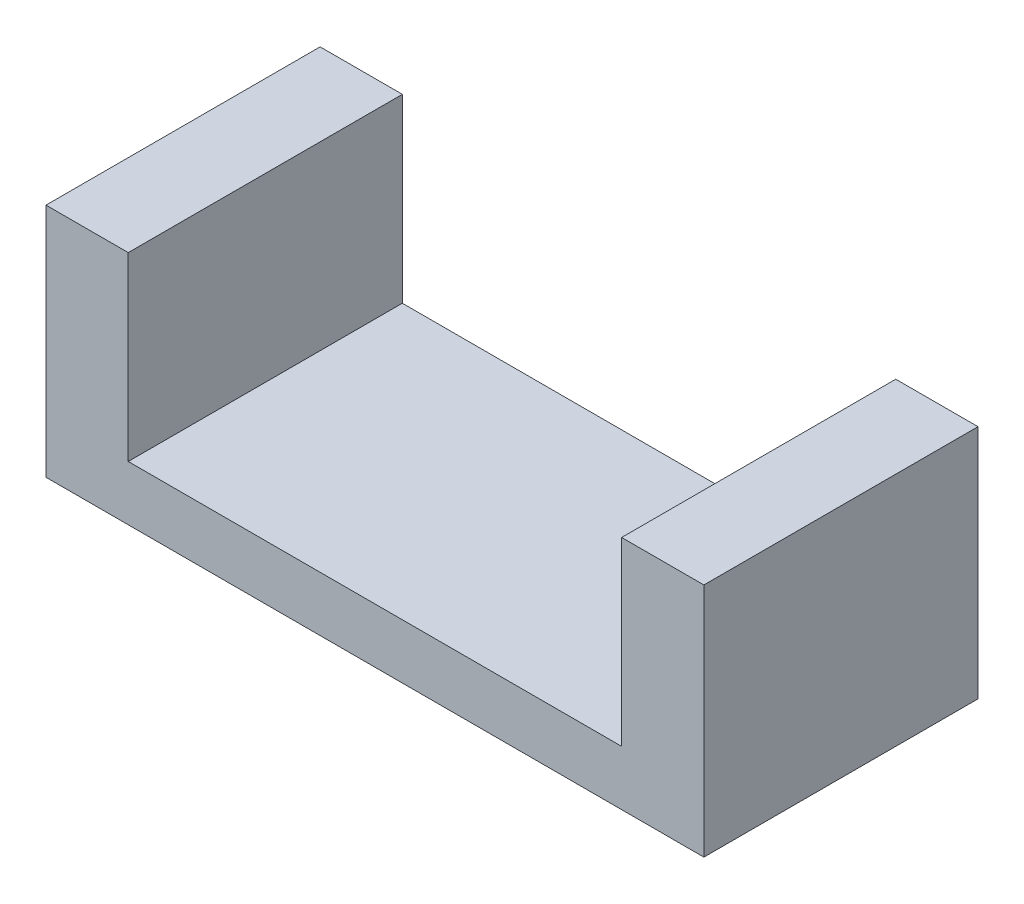
ISO-10303-21;
HEADER;
FILE_DESCRIPTION(('STEP AP214'),'2;1');
FILE_NAME('part.step','',(''),(''),'','','');
FILE_SCHEMA(('AUTOMOTIVE_DESIGN { 1 0 10303 214 1 1 1 1 }'));
ENDSEC;
DATA;
#1=APPLICATION_CONTEXT('core data for automotive mechanical design processes');
#2=APPLICATION_PROTOCOL_DEFINITION('international standard','automotive_design',2000,#1);
#3=PRODUCT_CONTEXT('',#1,'mechanical');
#4=PRODUCT('Part','Part','',(#3));
#5=PRODUCT_RELATED_PRODUCT_CATEGORY('part','',(#4));
#6=PRODUCT_DEFINITION_FORMATION('','',#4);
#7=PRODUCT_DEFINITION_CONTEXT('part definition',#1,'design');
#8=PRODUCT_DEFINITION('design','',#6,#7);
#9=PRODUCT_DEFINITION_SHAPE('','',#8);
#10=(LENGTH_UNIT() NAMED_UNIT(*) SI_UNIT(.MILLI.,.METRE.));
#11=(NAMED_UNIT(*) PLANE_ANGLE_UNIT() SI_UNIT($,.RADIAN.));
#12=(NAMED_UNIT(*) SI_UNIT($,.STERADIAN.) SOLID_ANGLE_UNIT());
#13=UNCERTAINTY_MEASURE_WITH_UNIT(LENGTH_MEASURE(1.E-05),#10,'distance_accuracy_value','');
#14=(GEOMETRIC_REPRESENTATION_CONTEXT(3) GLOBAL_UNCERTAINTY_ASSIGNED_CONTEXT((#13)) GLOBAL_UNIT_ASSIGNED_CONTEXT((#10,
#11,#12)) REPRESENTATION_CONTEXT('',''));
#15=CARTESIAN_POINT('',(0.,0.,0.));
#16=DIRECTION('',(0.,0.,1.));
#17=DIRECTION('',(1.,0.,0.));
#18=AXIS2_PLACEMENT_3D('',#15,#16,#17);
#19=CARTESIAN_POINT('',(0.,1.,2.5));
#20=DIRECTION('',(0.,0.,1.));
#21=DIRECTION('',(1.,0.,0.));
#22=AXIS2_PLACEMENT_3D('',#19,#20,#21);
#23=PLANE('',#22);
#24=DIRECTION('',(-1.,0.,0.));
#25=VECTOR('',#24,1.);
#26=CARTESIAN_POINT('',(0.,0.,2.5));
#27=LINE('',#26,#25);
#28=CARTESIAN_POINT('',(6.,0.,2.5));
#29=VERTEX_POINT('',#28);
#30=CARTESIAN_POINT('',(-6.,0.,2.5));
#31=VERTEX_POINT('',#30);
#32=EDGE_CURVE('E182',#29,#31,#27,.T.);
#33=ORIENTED_EDGE('',*,*,#32,.F.);
#34=DIRECTION('',(0.,-1.,0.));
#35=VECTOR('',#34,1.);
#36=CARTESIAN_POINT('',(6.,4.3,2.5));
#37=LINE('',#36,#35);
#38=CARTESIAN_POINT('',(6.,4.3,2.5));
#39=VERTEX_POINT('',#38);
#40=EDGE_CURVE('E165',#39,#29,#37,.T.);
#41=ORIENTED_EDGE('',*,*,#40,.F.);
#42=DIRECTION('',(-1.,0.,0.));
#43=VECTOR('',#42,1.);
#44=CARTESIAN_POINT('',(0.,4.3,2.5));
#45=LINE('',#44,#43);
#46=CARTESIAN_POINT('',(4.5,4.3,2.5));
#47=VERTEX_POINT('',#46);
#48=EDGE_CURVE('E161',#39,#47,#45,.T.);
#49=ORIENTED_EDGE('',*,*,#48,.T.);
#50=DIRECTION('',(0.,-1.,0.));
#51=VECTOR('',#50,1.);
#52=CARTESIAN_POINT('',(4.5,4.3,2.5));
#53=LINE('',#52,#51);
#54=CARTESIAN_POINT('',(4.5,1.,2.5));
#55=VERTEX_POINT('',#54);
#56=EDGE_CURVE('E172',#47,#55,#53,.T.);
#57=ORIENTED_EDGE('',*,*,#56,.T.);
#58=DIRECTION('',(-1.,0.,0.));
#59=VECTOR('',#58,1.);
#60=CARTESIAN_POINT('',(0.,1.,2.5));
#61=LINE('',#60,#59);
#62=CARTESIAN_POINT('',(-4.5,1.,2.5));
#63=VERTEX_POINT('',#62);
#64=EDGE_CURVE('E185',#55,#63,#61,.T.);
#65=ORIENTED_EDGE('',*,*,#64,.T.);
#66=DIRECTION('',(0.,-1.,0.));
#67=VECTOR('',#66,1.);
#68=CARTESIAN_POINT('',(-4.5,4.3,2.5));
#69=LINE('',#68,#67);
#70=CARTESIAN_POINT('',(-4.5,4.3,2.5));
#71=VERTEX_POINT('',#70);
#72=EDGE_CURVE('E119',#71,#63,#69,.T.);
#73=ORIENTED_EDGE('',*,*,#72,.F.);
#74=DIRECTION('',(-1.,0.,0.));
#75=VECTOR('',#74,1.);
#76=CARTESIAN_POINT('',(0.,4.3,2.5));
#77=LINE('',#76,#75);
#78=CARTESIAN_POINT('',(-6.,4.3,2.5));
#79=VERTEX_POINT('',#78);
#80=EDGE_CURVE('E124',#71,#79,#77,.T.);
#81=ORIENTED_EDGE('',*,*,#80,.T.);
#82=DIRECTION('',(0.,-1.,0.));
#83=VECTOR('',#82,1.);
#84=CARTESIAN_POINT('',(-6.,4.3,2.5));
#85=LINE('',#84,#83);
#86=EDGE_CURVE('E108',#79,#31,#85,.T.);
#87=ORIENTED_EDGE('',*,*,#86,.T.);
#88=EDGE_LOOP('',(#33,#41,#49,#57,#65,#73,#81,#87));
#89=FACE_BOUND('',#88,.T.);
#90=ADVANCED_FACE('F39',(#89),#23,.T.);
#91=CARTESIAN_POINT('',(0.,1.,-2.5));
#92=DIRECTION('',(0.,0.,1.));
#93=DIRECTION('',(1.,0.,0.));
#94=AXIS2_PLACEMENT_3D('',#91,#92,#93);
#95=PLANE('',#94);
#96=DIRECTION('',(-1.,0.,0.));
#97=VECTOR('',#96,1.);
#98=CARTESIAN_POINT('',(0.,0.,-2.5));
#99=LINE('',#98,#97);
#100=CARTESIAN_POINT('',(6.,0.,-2.5));
#101=VERTEX_POINT('',#100);
#102=CARTESIAN_POINT('',(-6.,0.,-2.5));
#103=VERTEX_POINT('',#102);
#104=EDGE_CURVE('E42',#101,#103,#99,.T.);
#105=ORIENTED_EDGE('',*,*,#104,.T.);
#106=DIRECTION('',(0.,-1.,0.));
#107=VECTOR('',#106,1.);
#108=CARTESIAN_POINT('',(-6.,4.3,-2.5));
#109=LINE('',#108,#107);
#110=CARTESIAN_POINT('',(-6.,4.3,-2.5));
#111=VERTEX_POINT('',#110);
#112=EDGE_CURVE('E140',#111,#103,#109,.T.);
#113=ORIENTED_EDGE('',*,*,#112,.F.);
#114=DIRECTION('',(-1.,0.,0.));
#115=VECTOR('',#114,1.);
#116=CARTESIAN_POINT('',(0.,4.3,-2.5));
#117=LINE('',#116,#115);
#118=CARTESIAN_POINT('',(-4.5,4.3,-2.5));
#119=VERTEX_POINT('',#118);
#120=EDGE_CURVE('E126',#119,#111,#117,.T.);
#121=ORIENTED_EDGE('',*,*,#120,.F.);
#122=DIRECTION('',(0.,-1.,0.));
#123=VECTOR('',#122,1.);
#124=CARTESIAN_POINT('',(-4.5,4.3,-2.5));
#125=LINE('',#124,#123);
#126=CARTESIAN_POINT('',(-4.5,1.,-2.5));
#127=VERTEX_POINT('',#126);
#128=EDGE_CURVE('E145',#119,#127,#125,.T.);
#129=ORIENTED_EDGE('',*,*,#128,.T.);
#130=DIRECTION('',(-1.,0.,0.));
#131=VECTOR('',#130,1.);
#132=CARTESIAN_POINT('',(0.,1.,-2.5));
#133=LINE('',#132,#131);
#134=CARTESIAN_POINT('',(4.5,1.,-2.5));
#135=VERTEX_POINT('',#134);
#136=EDGE_CURVE('E11',#135,#127,#133,.T.);
#137=ORIENTED_EDGE('',*,*,#136,.F.);
#138=DIRECTION('',(0.,-1.,0.));
#139=VECTOR('',#138,1.);
#140=CARTESIAN_POINT('',(4.5,4.3,-2.5));
#141=LINE('',#140,#139);
#142=CARTESIAN_POINT('',(4.5,4.3,-2.5));
#143=VERTEX_POINT('',#142);
#144=EDGE_CURVE('E56',#143,#135,#141,.T.);
#145=ORIENTED_EDGE('',*,*,#144,.F.);
#146=DIRECTION('',(-1.,0.,0.));
#147=VECTOR('',#146,1.);
#148=CARTESIAN_POINT('',(0.,4.3,-2.5));
#149=LINE('',#148,#147);
#150=CARTESIAN_POINT('',(6.,4.3,-2.5));
#151=VERTEX_POINT('',#150);
#152=EDGE_CURVE('E155',#151,#143,#149,.T.);
#153=ORIENTED_EDGE('',*,*,#152,.F.);
#154=DIRECTION('',(0.,-1.,0.));
#155=VECTOR('',#154,1.);
#156=CARTESIAN_POINT('',(6.,4.3,-2.5));
#157=LINE('',#156,#155);
#158=EDGE_CURVE('E178',#151,#101,#157,.T.);
#159=ORIENTED_EDGE('',*,*,#158,.T.);
#160=EDGE_LOOP('',(#105,#113,#121,#129,#137,#145,#153,#159));
#161=FACE_BOUND('',#160,.T.);
#162=ADVANCED_FACE('F194',(#161),#95,.F.);
#163=CARTESIAN_POINT('',(0.,1.,0.));
#164=DIRECTION('',(0.,1.,0.));
#165=DIRECTION('',(0.,0.,1.));
#166=AXIS2_PLACEMENT_3D('',#163,#164,#165);
#167=PLANE('',#166);
#168=DIRECTION('',(0.,0.,-1.));
#169=VECTOR('',#168,1.);
#170=CARTESIAN_POINT('',(-4.5,1.,0.));
#171=LINE('',#170,#169);
#172=EDGE_CURVE('E63',#63,#127,#171,.T.);
#173=ORIENTED_EDGE('',*,*,#172,.F.);
#174=ORIENTED_EDGE('',*,*,#64,.F.);
#175=DIRECTION('',(0.,0.,-1.));
#176=VECTOR('',#175,1.);
#177=CARTESIAN_POINT('',(4.5,1.,0.));
#178=LINE('',#177,#176);
#179=EDGE_CURVE('E48',#55,#135,#178,.T.);
#180=ORIENTED_EDGE('',*,*,#179,.T.);
#181=ORIENTED_EDGE('',*,*,#136,.T.);
#182=EDGE_LOOP('',(#173,#174,#180,#181));
#183=FACE_BOUND('',#182,.T.);
#184=ADVANCED_FACE('F199',(#183),#167,.T.);
#185=CARTESIAN_POINT('',(0.,0.,0.));
#186=DIRECTION('',(0.,1.,0.));
#187=DIRECTION('',(0.,0.,1.));
#188=AXIS2_PLACEMENT_3D('',#185,#186,#187);
#189=PLANE('',#188);
#190=ORIENTED_EDGE('',*,*,#32,.T.);
#191=DIRECTION('',(0.,0.,-1.));
#192=VECTOR('',#191,1.);
#193=CARTESIAN_POINT('',(-6.,0.,0.));
#194=LINE('',#193,#192);
#195=EDGE_CURVE('E114',#31,#103,#194,.T.);
#196=ORIENTED_EDGE('',*,*,#195,.T.);
#197=ORIENTED_EDGE('',*,*,#104,.F.);
#198=DIRECTION('',(0.,0.,-1.));
#199=VECTOR('',#198,1.);
#200=CARTESIAN_POINT('',(6.,0.,0.));
#201=LINE('',#200,#199);
#202=EDGE_CURVE('E118',#29,#101,#201,.T.);
#203=ORIENTED_EDGE('',*,*,#202,.F.);
#204=EDGE_LOOP('',(#190,#196,#197,#203));
#205=FACE_BOUND('',#204,.T.);
#206=ADVANCED_FACE('F196',(#205),#189,.F.);
#207=CARTESIAN_POINT('',(4.5,4.3,0.));
#208=DIRECTION('',(-1.,0.,0.));
#209=DIRECTION('',(0.,0.,1.));
#210=AXIS2_PLACEMENT_3D('',#207,#208,#209);
#211=PLANE('',#210);
#212=ORIENTED_EDGE('',*,*,#179,.F.);
#213=ORIENTED_EDGE('',*,*,#56,.F.);
#214=DIRECTION('',(0.,0.,-1.));
#215=VECTOR('',#214,1.);
#216=CARTESIAN_POINT('',(4.5,4.3,0.));
#217=LINE('',#216,#215);
#218=EDGE_CURVE('E158',#47,#143,#217,.T.);
#219=ORIENTED_EDGE('',*,*,#218,.T.);
#220=ORIENTED_EDGE('',*,*,#144,.T.);
#221=EDGE_LOOP('',(#212,#213,#219,#220));
#222=FACE_BOUND('',#221,.T.);
#223=ADVANCED_FACE('F198',(#222),#211,.T.);
#224=CARTESIAN_POINT('',(6.,4.3,0.));
#225=DIRECTION('',(-1.,0.,0.));
#226=DIRECTION('',(0.,0.,1.));
#227=AXIS2_PLACEMENT_3D('',#224,#225,#226);
#228=PLANE('',#227);
#229=ORIENTED_EDGE('',*,*,#202,.T.);
#230=ORIENTED_EDGE('',*,*,#158,.F.);
#231=DIRECTION('',(0.,0.,-1.));
#232=VECTOR('',#231,1.);
#233=CARTESIAN_POINT('',(6.,4.3,0.));
#234=LINE('',#233,#232);
#235=EDGE_CURVE('E151',#39,#151,#234,.T.);
#236=ORIENTED_EDGE('',*,*,#235,.F.);
#237=ORIENTED_EDGE('',*,*,#40,.T.);
#238=EDGE_LOOP('',(#229,#230,#236,#237));
#239=FACE_BOUND('',#238,.T.);
#240=ADVANCED_FACE('F205',(#239),#228,.F.);
#241=CARTESIAN_POINT('',(0.,4.3,0.));
#242=DIRECTION('',(0.,1.,0.));
#243=DIRECTION('',(0.,0.,1.));
#244=AXIS2_PLACEMENT_3D('',#241,#242,#243);
#245=PLANE('',#244);
#246=ORIENTED_EDGE('',*,*,#235,.T.);
#247=ORIENTED_EDGE('',*,*,#152,.T.);
#248=ORIENTED_EDGE('',*,*,#218,.F.);
#249=ORIENTED_EDGE('',*,*,#48,.F.);
#250=EDGE_LOOP('',(#246,#247,#248,#249));
#251=FACE_BOUND('',#250,.T.);
#252=ADVANCED_FACE('F240',(#251),#245,.T.);
#253=CARTESIAN_POINT('',(-4.5,4.3,0.));
#254=DIRECTION('',(-1.,0.,0.));
#255=DIRECTION('',(0.,0.,1.));
#256=AXIS2_PLACEMENT_3D('',#253,#254,#255);
#257=PLANE('',#256);
#258=ORIENTED_EDGE('',*,*,#72,.T.);
#259=ORIENTED_EDGE('',*,*,#172,.T.);
#260=ORIENTED_EDGE('',*,*,#128,.F.);
#261=DIRECTION('',(0.,0.,-1.));
#262=VECTOR('',#261,1.);
#263=CARTESIAN_POINT('',(-4.5,4.3,0.));
#264=LINE('',#263,#262);
#265=EDGE_CURVE('E133',#71,#119,#264,.T.);
#266=ORIENTED_EDGE('',*,*,#265,.F.);
#267=EDGE_LOOP('',(#258,#259,#260,#266));
#268=FACE_BOUND('',#267,.T.);
#269=ADVANCED_FACE('F250',(#268),#257,.F.);
#270=CARTESIAN_POINT('',(-6.,4.3,0.));
#271=DIRECTION('',(-1.,0.,0.));
#272=DIRECTION('',(0.,0.,1.));
#273=AXIS2_PLACEMENT_3D('',#270,#271,#272);
#274=PLANE('',#273);
#275=ORIENTED_EDGE('',*,*,#195,.F.);
#276=ORIENTED_EDGE('',*,*,#86,.F.);
#277=DIRECTION('',(0.,0.,-1.));
#278=VECTOR('',#277,1.);
#279=CARTESIAN_POINT('',(-6.,4.3,0.));
#280=LINE('',#279,#278);
#281=EDGE_CURVE('E112',#79,#111,#280,.T.);
#282=ORIENTED_EDGE('',*,*,#281,.T.);
#283=ORIENTED_EDGE('',*,*,#112,.T.);
#284=EDGE_LOOP('',(#275,#276,#282,#283));
#285=FACE_BOUND('',#284,.T.);
#286=ADVANCED_FACE('F110',(#285),#274,.T.);
#287=CARTESIAN_POINT('',(0.,4.3,0.));
#288=DIRECTION('',(0.,1.,0.));
#289=DIRECTION('',(0.,0.,1.));
#290=AXIS2_PLACEMENT_3D('',#287,#288,#289);
#291=PLANE('',#290);
#292=ORIENTED_EDGE('',*,*,#281,.F.);
#293=ORIENTED_EDGE('',*,*,#80,.F.);
#294=ORIENTED_EDGE('',*,*,#265,.T.);
#295=ORIENTED_EDGE('',*,*,#120,.T.);
#296=EDGE_LOOP('',(#292,#293,#294,#295));
#297=FACE_BOUND('',#296,.T.);
#298=ADVANCED_FACE('F123',(#297),#291,.T.);
#299=CLOSED_SHELL('',(#90,#162,#184,#206,#223,#240,#252,#269,#286,#298));
#300=MANIFOLD_SOLID_BREP('B2',#299);
#301=ADVANCED_BREP_SHAPE_REPRESENTATION('',(#18,#300),#14);
#302=SHAPE_DEFINITION_REPRESENTATION(#9,#301);
ENDSEC;
END-ISO-10303-21;
